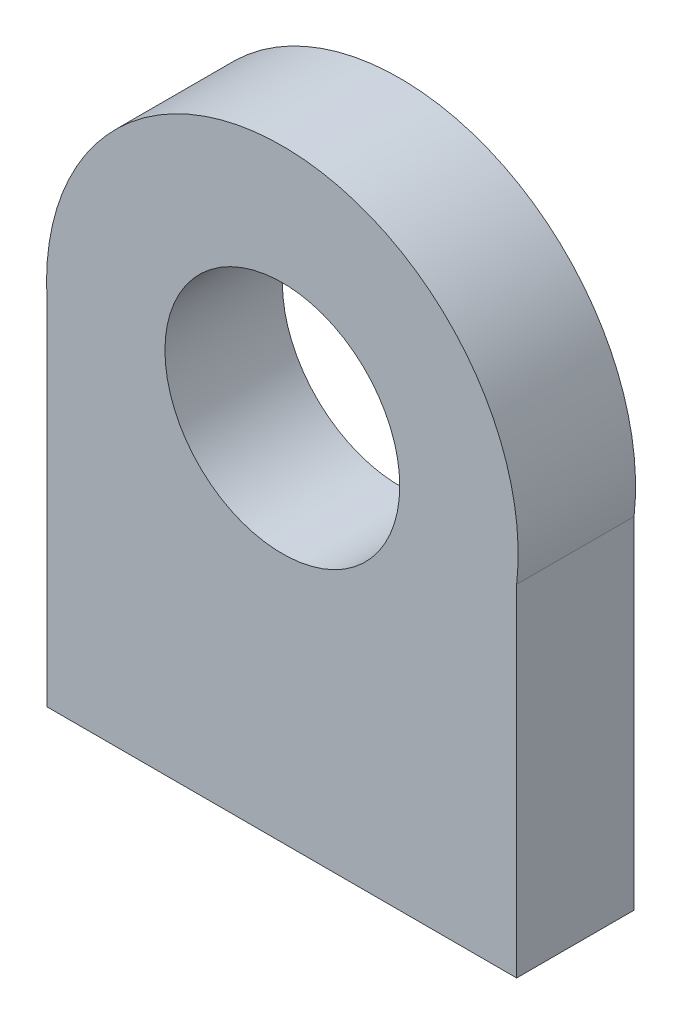
ISO-10303-21;
HEADER;
FILE_DESCRIPTION(('STEP AP214'),'2;1');
FILE_NAME('part.step','',(''),(''),'','','');
FILE_SCHEMA(('AUTOMOTIVE_DESIGN { 1 0 10303 214 1 1 1 1 }'));
ENDSEC;
DATA;
#1=APPLICATION_CONTEXT('core data for automotive mechanical design processes');
#2=APPLICATION_PROTOCOL_DEFINITION('international standard','automotive_design',2000,#1);
#3=PRODUCT_CONTEXT('',#1,'mechanical');
#4=PRODUCT('Part','Part','',(#3));
#5=PRODUCT_RELATED_PRODUCT_CATEGORY('part','',(#4));
#6=PRODUCT_DEFINITION_FORMATION('','',#4);
#7=PRODUCT_DEFINITION_CONTEXT('part definition',#1,'design');
#8=PRODUCT_DEFINITION('design','',#6,#7);
#9=PRODUCT_DEFINITION_SHAPE('','',#8);
#10=(LENGTH_UNIT() NAMED_UNIT(*) SI_UNIT(.MILLI.,.METRE.));
#11=(NAMED_UNIT(*) PLANE_ANGLE_UNIT() SI_UNIT($,.RADIAN.));
#12=(NAMED_UNIT(*) SI_UNIT($,.STERADIAN.) SOLID_ANGLE_UNIT());
#13=UNCERTAINTY_MEASURE_WITH_UNIT(LENGTH_MEASURE(1.E-05),#10,'distance_accuracy_value','');
#14=(GEOMETRIC_REPRESENTATION_CONTEXT(3) GLOBAL_UNCERTAINTY_ASSIGNED_CONTEXT((#13)) GLOBAL_UNIT_ASSIGNED_CONTEXT((#10,
#11,#12)) REPRESENTATION_CONTEXT('',''));
#15=CARTESIAN_POINT('',(0.,0.,0.));
#16=DIRECTION('',(0.,0.,1.));
#17=DIRECTION('',(1.,0.,0.));
#18=AXIS2_PLACEMENT_3D('',#15,#16,#17);
#19=CARTESIAN_POINT('',(18.1380073810176,0.,10.));
#20=DIRECTION('',(-1.,0.,0.));
#21=DIRECTION('',(0.,0.,1.));
#22=AXIS2_PLACEMENT_3D('',#19,#20,#21);
#23=PLANE('',#22);
#24=DIRECTION('',(0.,1.,0.));
#25=VECTOR('',#24,1.);
#26=CARTESIAN_POINT('',(18.1380073810176,0.,0.));
#27=LINE('',#26,#25);
#28=CARTESIAN_POINT('',(18.1380073810176,-15.0002018807366,0.));
#29=VERTEX_POINT('',#28);
#30=CARTESIAN_POINT('',(18.1380073810176,14.0353722174642,0.));
#31=VERTEX_POINT('',#30);
#32=EDGE_CURVE('E107',#29,#31,#27,.T.);
#33=ORIENTED_EDGE('',*,*,#32,.T.);
#34=DIRECTION('',(0.,0.,-1.));
#35=VECTOR('',#34,1.);
#36=CARTESIAN_POINT('',(18.1380073810176,14.0353722174642,10.));
#37=LINE('',#36,#35);
#38=CARTESIAN_POINT('',(18.1380073810176,14.0353722174642,10.));
#39=VERTEX_POINT('',#38);
#40=EDGE_CURVE('E11',#39,#31,#37,.T.);
#41=ORIENTED_EDGE('',*,*,#40,.F.);
#42=DIRECTION('',(0.,1.,0.));
#43=VECTOR('',#42,1.);
#44=CARTESIAN_POINT('',(18.1380073810176,0.,10.));
#45=LINE('',#44,#43);
#46=CARTESIAN_POINT('',(18.1380073810176,-15.0002018807366,10.));
#47=VERTEX_POINT('',#46);
#48=EDGE_CURVE('E89',#47,#39,#45,.T.);
#49=ORIENTED_EDGE('',*,*,#48,.F.);
#50=DIRECTION('',(0.,0.,-1.));
#51=VECTOR('',#50,1.);
#52=CARTESIAN_POINT('',(18.1380073810176,-15.0002018807366,10.));
#53=LINE('',#52,#51);
#54=EDGE_CURVE('E100',#47,#29,#53,.T.);
#55=ORIENTED_EDGE('',*,*,#54,.T.);
#56=EDGE_LOOP('',(#33,#41,#49,#55));
#57=FACE_BOUND('',#56,.T.);
#58=ADVANCED_FACE('F41',(#57),#23,.F.);
#59=CARTESIAN_POINT('',(-1.81862921462107,16.3161019556233,10.));
#60=DIRECTION('',(0.,0.,-1.));
#61=DIRECTION('',(-1.,0.,0.));
#62=AXIS2_PLACEMENT_3D('',#59,#60,#61);
#63=CYLINDRICAL_SURFACE('',#62,20.0865395812446);
#64=CARTESIAN_POINT('',(-1.81862921462107,16.3161019556233,0.));
#65=DIRECTION('',(0.,0.,1.));
#66=DIRECTION('',(1.,0.,0.));
#67=AXIS2_PLACEMENT_3D('',#64,#65,#66);
#68=CIRCLE('',#67,20.0865395812446);
#69=CARTESIAN_POINT('',(-21.8619926189824,14.9997981192634,0.));
#70=VERTEX_POINT('',#69);
#71=EDGE_CURVE('E94',#31,#70,#68,.T.);
#72=ORIENTED_EDGE('',*,*,#71,.T.);
#73=DIRECTION('',(0.,0.,-1.));
#74=VECTOR('',#73,1.);
#75=CARTESIAN_POINT('',(-21.8619926189824,14.9997981192634,10.));
#76=LINE('',#75,#74);
#77=CARTESIAN_POINT('',(-21.8619926189824,14.9997981192634,10.));
#78=VERTEX_POINT('',#77);
#79=EDGE_CURVE('E50',#78,#70,#76,.T.);
#80=ORIENTED_EDGE('',*,*,#79,.F.);
#81=CARTESIAN_POINT('',(-1.81862921462107,16.3161019556233,10.));
#82=DIRECTION('',(0.,0.,1.));
#83=DIRECTION('',(1.,0.,0.));
#84=AXIS2_PLACEMENT_3D('',#81,#82,#83);
#85=CIRCLE('',#84,20.0865395812446);
#86=EDGE_CURVE('E84',#39,#78,#85,.T.);
#87=ORIENTED_EDGE('',*,*,#86,.F.);
#88=ORIENTED_EDGE('',*,*,#40,.T.);
#89=EDGE_LOOP('',(#72,#80,#87,#88));
#90=FACE_BOUND('',#89,.T.);
#91=ADVANCED_FACE('F93',(#90),#63,.T.);
#92=CARTESIAN_POINT('',(-21.8619926189824,0.,10.));
#93=DIRECTION('',(-1.,0.,0.));
#94=DIRECTION('',(0.,0.,1.));
#95=AXIS2_PLACEMENT_3D('',#92,#93,#94);
#96=PLANE('',#95);
#97=DIRECTION('',(0.,1.,0.));
#98=VECTOR('',#97,1.);
#99=CARTESIAN_POINT('',(-21.8619926189824,0.,0.));
#100=LINE('',#99,#98);
#101=CARTESIAN_POINT('',(-21.8619926189824,-15.0002018807366,0.));
#102=VERTEX_POINT('',#101);
#103=EDGE_CURVE('E111',#102,#70,#100,.T.);
#104=ORIENTED_EDGE('',*,*,#103,.F.);
#105=DIRECTION('',(0.,0.,-1.));
#106=VECTOR('',#105,1.);
#107=CARTESIAN_POINT('',(-21.8619926189824,-15.0002018807366,10.));
#108=LINE('',#107,#106);
#109=CARTESIAN_POINT('',(-21.8619926189824,-15.0002018807366,10.));
#110=VERTEX_POINT('',#109);
#111=EDGE_CURVE('E74',#110,#102,#108,.T.);
#112=ORIENTED_EDGE('',*,*,#111,.F.);
#113=DIRECTION('',(0.,1.,0.));
#114=VECTOR('',#113,1.);
#115=CARTESIAN_POINT('',(-21.8619926189824,0.,10.));
#116=LINE('',#115,#114);
#117=EDGE_CURVE('E87',#110,#78,#116,.T.);
#118=ORIENTED_EDGE('',*,*,#117,.T.);
#119=ORIENTED_EDGE('',*,*,#79,.T.);
#120=EDGE_LOOP('',(#104,#112,#118,#119));
#121=FACE_BOUND('',#120,.T.);
#122=ADVANCED_FACE('F98',(#121),#96,.T.);
#123=CARTESIAN_POINT('',(-1.81862921462107,16.3161019556233,10.));
#124=DIRECTION('',(0.,0.,-1.));
#125=DIRECTION('',(-1.,0.,0.));
#126=AXIS2_PLACEMENT_3D('',#123,#124,#125);
#127=CYLINDRICAL_SURFACE('',#126,10.);
#128=CARTESIAN_POINT('',(-1.81862921462107,16.3161019556233,10.));
#129=DIRECTION('',(0.,0.,1.));
#130=DIRECTION('',(1.,0.,0.));
#131=AXIS2_PLACEMENT_3D('',#128,#129,#130);
#132=CIRCLE('',#131,10.);
#133=CARTESIAN_POINT('',(8.18137078537894,16.3161019556233,10.));
#134=VERTEX_POINT('',#133);
#135=EDGE_CURVE('E114',#134,#134,#132,.T.);
#136=ORIENTED_EDGE('',*,*,#135,.T.);
#137=EDGE_LOOP('',(#136));
#138=FACE_BOUND('',#137,.T.);
#139=CARTESIAN_POINT('',(-1.81862921462107,16.3161019556233,0.));
#140=DIRECTION('',(0.,0.,1.));
#141=DIRECTION('',(1.,0.,0.));
#142=AXIS2_PLACEMENT_3D('',#139,#140,#141);
#143=CIRCLE('',#142,10.);
#144=CARTESIAN_POINT('',(8.18137078537894,16.3161019556233,0.));
#145=VERTEX_POINT('',#144);
#146=EDGE_CURVE('E104',#145,#145,#143,.T.);
#147=ORIENTED_EDGE('',*,*,#146,.F.);
#148=EDGE_LOOP('',(#147));
#149=FACE_BOUND('',#148,.T.);
#150=ADVANCED_FACE('F43',(#138,#149),#127,.F.);
#151=CARTESIAN_POINT('',(0.,-15.0002018807366,10.));
#152=DIRECTION('',(0.,1.,0.));
#153=DIRECTION('',(0.,0.,1.));
#154=AXIS2_PLACEMENT_3D('',#151,#152,#153);
#155=PLANE('',#154);
#156=DIRECTION('',(1.,0.,0.));
#157=VECTOR('',#156,1.);
#158=CARTESIAN_POINT('',(0.,-15.0002018807366,0.));
#159=LINE('',#158,#157);
#160=EDGE_CURVE('E77',#102,#29,#159,.T.);
#161=ORIENTED_EDGE('',*,*,#160,.T.);
#162=ORIENTED_EDGE('',*,*,#54,.F.);
#163=DIRECTION('',(1.,0.,0.));
#164=VECTOR('',#163,1.);
#165=CARTESIAN_POINT('',(0.,-15.0002018807366,10.));
#166=LINE('',#165,#164);
#167=EDGE_CURVE('E58',#110,#47,#166,.T.);
#168=ORIENTED_EDGE('',*,*,#167,.F.);
#169=ORIENTED_EDGE('',*,*,#111,.T.);
#170=EDGE_LOOP('',(#161,#162,#168,#169));
#171=FACE_BOUND('',#170,.T.);
#172=ADVANCED_FACE('F126',(#171),#155,.F.);
#173=CARTESIAN_POINT('',(0.,0.,10.));
#174=DIRECTION('',(0.,0.,1.));
#175=DIRECTION('',(1.,0.,0.));
#176=AXIS2_PLACEMENT_3D('',#173,#174,#175);
#177=PLANE('',#176);
#178=ORIENTED_EDGE('',*,*,#135,.F.);
#179=EDGE_LOOP('',(#178));
#180=FACE_BOUND('',#179,.T.);
#181=ORIENTED_EDGE('',*,*,#48,.T.);
#182=ORIENTED_EDGE('',*,*,#86,.T.);
#183=ORIENTED_EDGE('',*,*,#117,.F.);
#184=ORIENTED_EDGE('',*,*,#167,.T.);
#185=EDGE_LOOP('',(#181,#182,#183,#184));
#186=FACE_BOUND('',#185,.T.);
#187=ADVANCED_FACE('F85',(#180,#186),#177,.T.);
#188=CARTESIAN_POINT('',(0.,0.,0.));
#189=DIRECTION('',(0.,0.,1.));
#190=DIRECTION('',(1.,0.,0.));
#191=AXIS2_PLACEMENT_3D('',#188,#189,#190);
#192=PLANE('',#191);
#193=ORIENTED_EDGE('',*,*,#146,.T.);
#194=EDGE_LOOP('',(#193));
#195=FACE_BOUND('',#194,.T.);
#196=ORIENTED_EDGE('',*,*,#32,.F.);
#197=ORIENTED_EDGE('',*,*,#160,.F.);
#198=ORIENTED_EDGE('',*,*,#103,.T.);
#199=ORIENTED_EDGE('',*,*,#71,.F.);
#200=EDGE_LOOP('',(#196,#197,#198,#199));
#201=FACE_BOUND('',#200,.T.);
#202=ADVANCED_FACE('F119',(#195,#201),#192,.F.);
#203=CLOSED_SHELL('',(#58,#91,#122,#150,#172,#187,#202));
#204=MANIFOLD_SOLID_BREP('B2',#203);
#205=ADVANCED_BREP_SHAPE_REPRESENTATION('',(#18,#204),#14);
#206=SHAPE_DEFINITION_REPRESENTATION(#9,#205);
ENDSEC;
END-ISO-10303-21;
